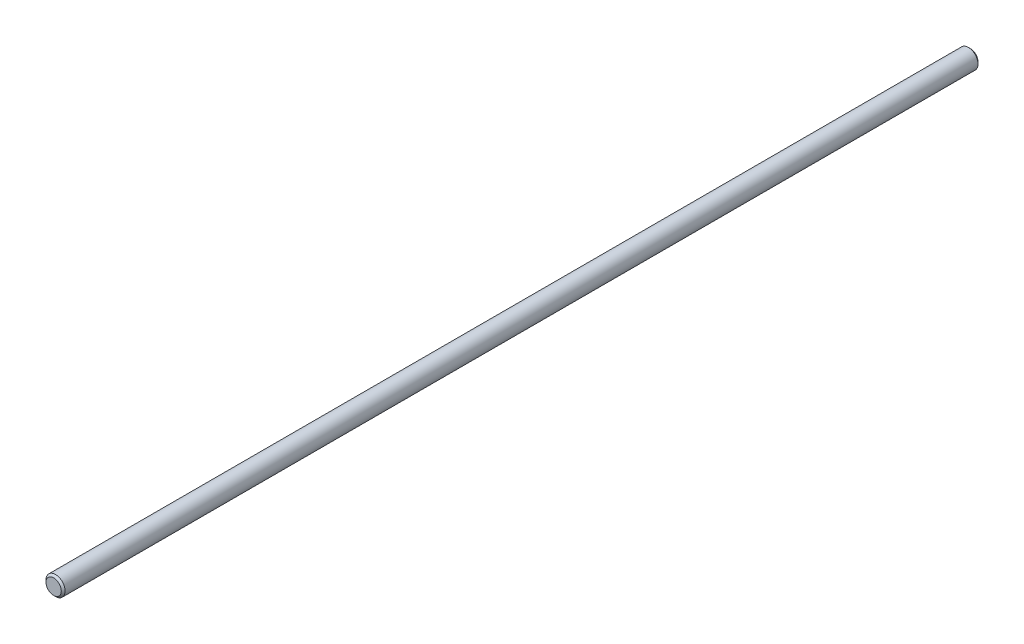
ISO-10303-21;
HEADER;
FILE_DESCRIPTION(('STEP AP214'),'2;1');
FILE_NAME('part.step','',(''),(''),'','','');
FILE_SCHEMA(('AUTOMOTIVE_DESIGN { 1 0 10303 214 1 1 1 1 }'));
ENDSEC;
DATA;
#1=APPLICATION_CONTEXT('core data for automotive mechanical design processes');
#2=APPLICATION_PROTOCOL_DEFINITION('international standard','automotive_design',2000,#1);
#3=PRODUCT_CONTEXT('',#1,'mechanical');
#4=PRODUCT('Part','Part','',(#3));
#5=PRODUCT_RELATED_PRODUCT_CATEGORY('part','',(#4));
#6=PRODUCT_DEFINITION_FORMATION('','',#4);
#7=PRODUCT_DEFINITION_CONTEXT('part definition',#1,'design');
#8=PRODUCT_DEFINITION('design','',#6,#7);
#9=PRODUCT_DEFINITION_SHAPE('','',#8);
#10=(LENGTH_UNIT() NAMED_UNIT(*) SI_UNIT(.MILLI.,.METRE.));
#11=(NAMED_UNIT(*) PLANE_ANGLE_UNIT() SI_UNIT($,.RADIAN.));
#12=(NAMED_UNIT(*) SI_UNIT($,.STERADIAN.) SOLID_ANGLE_UNIT());
#13=UNCERTAINTY_MEASURE_WITH_UNIT(LENGTH_MEASURE(1.E-05),#10,'distance_accuracy_value','');
#14=(GEOMETRIC_REPRESENTATION_CONTEXT(3) GLOBAL_UNCERTAINTY_ASSIGNED_CONTEXT((#13)) GLOBAL_UNIT_ASSIGNED_CONTEXT((#10,
#11,#12)) REPRESENTATION_CONTEXT('',''));
#15=CARTESIAN_POINT('',(0.,0.,0.));
#16=DIRECTION('',(0.,0.,1.));
#17=DIRECTION('',(1.,0.,0.));
#18=AXIS2_PLACEMENT_3D('',#15,#16,#17);
#19=CARTESIAN_POINT('',(0.,0.,304.8));
#20=DIRECTION('',(0.,0.,-1.));
#21=DIRECTION('',(-1.,0.,0.));
#22=AXIS2_PLACEMENT_3D('',#19,#20,#21);
#23=CYLINDRICAL_SURFACE('',#22,6.35);
#24=CARTESIAN_POINT('',(0.,0.,-303.529999999999));
#25=DIRECTION('',(0.,0.,1.));
#26=DIRECTION('',(1.,0.,0.));
#27=AXIS2_PLACEMENT_3D('',#24,#25,#26);
#28=CIRCLE('',#27,6.35);
#29=CARTESIAN_POINT('',(6.35,0.,-303.529999999999));
#30=VERTEX_POINT('',#29);
#31=EDGE_CURVE('E41',#30,#30,#28,.T.);
#32=ORIENTED_EDGE('',*,*,#31,.T.);
#33=EDGE_LOOP('',(#32));
#34=FACE_BOUND('',#33,.T.);
#35=CARTESIAN_POINT('',(0.,0.,303.53));
#36=DIRECTION('',(0.,0.,1.));
#37=DIRECTION('',(1.,0.,0.));
#38=AXIS2_PLACEMENT_3D('',#35,#36,#37);
#39=CIRCLE('',#38,6.35);
#40=CARTESIAN_POINT('',(6.35,0.,303.53));
#41=VERTEX_POINT('',#40);
#42=EDGE_CURVE('E45',#41,#41,#39,.F.);
#43=ORIENTED_EDGE('',*,*,#42,.T.);
#44=EDGE_LOOP('',(#43));
#45=FACE_BOUND('',#44,.T.);
#46=ADVANCED_FACE('F30',(#34,#45),#23,.T.);
#47=CARTESIAN_POINT('',(0.,0.,304.8));
#48=DIRECTION('',(0.,0.,1.));
#49=DIRECTION('',(1.,0.,0.));
#50=AXIS2_PLACEMENT_3D('',#47,#48,#49);
#51=PLANE('',#50);
#52=CARTESIAN_POINT('',(0.,0.,304.8));
#53=DIRECTION('',(0.,0.,1.));
#54=DIRECTION('',(1.,0.,0.));
#55=AXIS2_PLACEMENT_3D('',#52,#53,#54);
#56=CIRCLE('',#55,5.08000000000047);
#57=CARTESIAN_POINT('',(5.08000000000047,0.,304.8));
#58=VERTEX_POINT('',#57);
#59=EDGE_CURVE('E10',#58,#58,#56,.T.);
#60=ORIENTED_EDGE('',*,*,#59,.T.);
#61=EDGE_LOOP('',(#60));
#62=FACE_BOUND('',#61,.T.);
#63=ADVANCED_FACE('F61',(#62),#51,.T.);
#64=CARTESIAN_POINT('',(0.,0.,-304.8));
#65=DIRECTION('',(0.,0.,1.));
#66=DIRECTION('',(1.,0.,0.));
#67=AXIS2_PLACEMENT_3D('',#64,#65,#66);
#68=PLANE('',#67);
#69=CARTESIAN_POINT('',(0.,0.,-304.8));
#70=DIRECTION('',(0.,0.,1.));
#71=DIRECTION('',(1.,0.,0.));
#72=AXIS2_PLACEMENT_3D('',#69,#70,#71);
#73=CIRCLE('',#72,5.07999999999931);
#74=CARTESIAN_POINT('',(5.07999999999931,0.,-304.8));
#75=VERTEX_POINT('',#74);
#76=EDGE_CURVE('E37',#75,#75,#73,.F.);
#77=ORIENTED_EDGE('',*,*,#76,.T.);
#78=EDGE_LOOP('',(#77));
#79=FACE_BOUND('',#78,.T.);
#80=ADVANCED_FACE('F58',(#79),#68,.F.);
#81=CARTESIAN_POINT('',(0.,0.,-303.529999999999));
#82=DIRECTION('',(0.,0.,1.));
#83=DIRECTION('',(1.,0.,0.));
#84=AXIS2_PLACEMENT_3D('',#81,#82,#83);
#85=CONICAL_SURFACE('',#84,6.35,0.785398163397462);
#86=ORIENTED_EDGE('',*,*,#76,.F.);
#87=EDGE_LOOP('',(#86));
#88=FACE_BOUND('',#87,.T.);
#89=ORIENTED_EDGE('',*,*,#31,.F.);
#90=EDGE_LOOP('',(#89));
#91=FACE_BOUND('',#90,.T.);
#92=ADVANCED_FACE('F54',(#88,#91),#85,.T.);
#93=CARTESIAN_POINT('',(0.,0.,304.8));
#94=DIRECTION('',(0.,0.,-1.));
#95=DIRECTION('',(-1.,0.,0.));
#96=AXIS2_PLACEMENT_3D('',#93,#94,#95);
#97=CONICAL_SURFACE('',#96,5.08000000000047,0.78539816339744);
#98=ORIENTED_EDGE('',*,*,#42,.F.);
#99=EDGE_LOOP('',(#98));
#100=FACE_BOUND('',#99,.T.);
#101=ORIENTED_EDGE('',*,*,#59,.F.);
#102=EDGE_LOOP('',(#101));
#103=FACE_BOUND('',#102,.T.);
#104=ADVANCED_FACE('F32',(#100,#103),#97,.T.);
#105=CLOSED_SHELL('',(#46,#63,#80,#92,#104));
#106=MANIFOLD_SOLID_BREP('B2',#105);
#107=ADVANCED_BREP_SHAPE_REPRESENTATION('',(#18,#106),#14);
#108=SHAPE_DEFINITION_REPRESENTATION(#9,#107);
ENDSEC;
END-ISO-10303-21;
